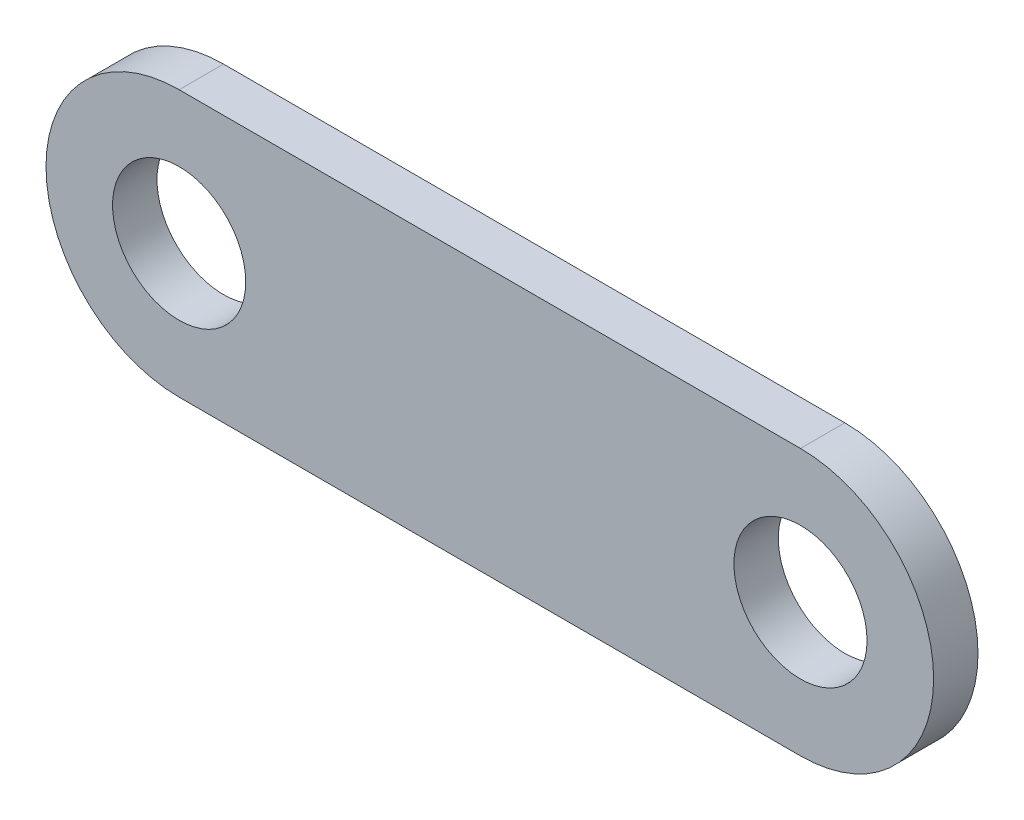
ISO-10303-21;
HEADER;
FILE_DESCRIPTION(('STEP AP214'),'2;1');
FILE_NAME('part.step','',(''),(''),'','','');
FILE_SCHEMA(('AUTOMOTIVE_DESIGN { 1 0 10303 214 1 1 1 1 }'));
ENDSEC;
DATA;
#1=APPLICATION_CONTEXT('core data for automotive mechanical design processes');
#2=APPLICATION_PROTOCOL_DEFINITION('international standard','automotive_design',2000,#1);
#3=PRODUCT_CONTEXT('',#1,'mechanical');
#4=PRODUCT('Part','Part','',(#3));
#5=PRODUCT_RELATED_PRODUCT_CATEGORY('part','',(#4));
#6=PRODUCT_DEFINITION_FORMATION('','',#4);
#7=PRODUCT_DEFINITION_CONTEXT('part definition',#1,'design');
#8=PRODUCT_DEFINITION('design','',#6,#7);
#9=PRODUCT_DEFINITION_SHAPE('','',#8);
#10=(LENGTH_UNIT() NAMED_UNIT(*) SI_UNIT(.MILLI.,.METRE.));
#11=(NAMED_UNIT(*) PLANE_ANGLE_UNIT() SI_UNIT($,.RADIAN.));
#12=(NAMED_UNIT(*) SI_UNIT($,.STERADIAN.) SOLID_ANGLE_UNIT());
#13=UNCERTAINTY_MEASURE_WITH_UNIT(LENGTH_MEASURE(1.E-05),#10,'distance_accuracy_value','');
#14=(GEOMETRIC_REPRESENTATION_CONTEXT(3) GLOBAL_UNCERTAINTY_ASSIGNED_CONTEXT((#13)) GLOBAL_UNIT_ASSIGNED_CONTEXT((#10,
#11,#12)) REPRESENTATION_CONTEXT('',''));
#15=CARTESIAN_POINT('',(0.,0.,0.));
#16=DIRECTION('',(0.,0.,1.));
#17=DIRECTION('',(1.,0.,0.));
#18=AXIS2_PLACEMENT_3D('',#15,#16,#17);
#19=CARTESIAN_POINT('',(0.,0.,-3.175));
#20=DIRECTION('',(0.,0.,1.));
#21=DIRECTION('',(1.,0.,0.));
#22=AXIS2_PLACEMENT_3D('',#19,#20,#21);
#23=CYLINDRICAL_SURFACE('',#22,9.525);
#24=CARTESIAN_POINT('',(0.,0.,0.));
#25=DIRECTION('',(0.,0.,1.));
#26=DIRECTION('',(1.,0.,0.));
#27=AXIS2_PLACEMENT_3D('',#24,#25,#26);
#28=CIRCLE('',#27,9.525);
#29=CARTESIAN_POINT('',(0.,-9.525,0.));
#30=VERTEX_POINT('',#29);
#31=CARTESIAN_POINT('',(0.,9.525,0.));
#32=VERTEX_POINT('',#31);
#33=EDGE_CURVE('E116',#30,#32,#28,.T.);
#34=ORIENTED_EDGE('',*,*,#33,.F.);
#35=DIRECTION('',(0.,0.,1.));
#36=VECTOR('',#35,1.);
#37=CARTESIAN_POINT('',(0.,-9.525,-3.175));
#38=LINE('',#37,#36);
#39=CARTESIAN_POINT('',(0.,-9.525,-3.175));
#40=VERTEX_POINT('',#39);
#41=EDGE_CURVE('E13',#40,#30,#38,.T.);
#42=ORIENTED_EDGE('',*,*,#41,.F.);
#43=CARTESIAN_POINT('',(0.,0.,-3.175));
#44=DIRECTION('',(0.,0.,1.));
#45=DIRECTION('',(1.,0.,0.));
#46=AXIS2_PLACEMENT_3D('',#43,#44,#45);
#47=CIRCLE('',#46,9.525);
#48=CARTESIAN_POINT('',(0.,9.525,-3.175));
#49=VERTEX_POINT('',#48);
#50=EDGE_CURVE('E109',#40,#49,#47,.T.);
#51=ORIENTED_EDGE('',*,*,#50,.T.);
#52=DIRECTION('',(0.,0.,1.));
#53=VECTOR('',#52,1.);
#54=CARTESIAN_POINT('',(0.,9.525,-3.175));
#55=LINE('',#54,#53);
#56=EDGE_CURVE('E54',#49,#32,#55,.T.);
#57=ORIENTED_EDGE('',*,*,#56,.T.);
#58=EDGE_LOOP('',(#34,#42,#51,#57));
#59=FACE_BOUND('',#58,.T.);
#60=ADVANCED_FACE('F51',(#59),#23,.T.);
#61=CARTESIAN_POINT('',(0.,-9.525,-3.175));
#62=DIRECTION('',(0.,-1.,0.));
#63=DIRECTION('',(1.,0.,0.));
#64=AXIS2_PLACEMENT_3D('',#61,#62,#63);
#65=PLANE('',#64);
#66=DIRECTION('',(1.,0.,0.));
#67=VECTOR('',#66,1.);
#68=CARTESIAN_POINT('',(0.,-9.525,0.));
#69=LINE('',#68,#67);
#70=CARTESIAN_POINT('',(-44.45,-9.525,0.));
#71=VERTEX_POINT('',#70);
#72=EDGE_CURVE('E111',#71,#30,#69,.T.);
#73=ORIENTED_EDGE('',*,*,#72,.F.);
#74=DIRECTION('',(0.,0.,1.));
#75=VECTOR('',#74,1.);
#76=CARTESIAN_POINT('',(-44.45,-9.525,-3.175));
#77=LINE('',#76,#75);
#78=CARTESIAN_POINT('',(-44.45,-9.525,-3.175));
#79=VERTEX_POINT('',#78);
#80=EDGE_CURVE('E60',#79,#71,#77,.T.);
#81=ORIENTED_EDGE('',*,*,#80,.F.);
#82=DIRECTION('',(1.,0.,0.));
#83=VECTOR('',#82,1.);
#84=CARTESIAN_POINT('',(0.,-9.525,-3.175));
#85=LINE('',#84,#83);
#86=EDGE_CURVE('E106',#79,#40,#85,.T.);
#87=ORIENTED_EDGE('',*,*,#86,.T.);
#88=ORIENTED_EDGE('',*,*,#41,.T.);
#89=EDGE_LOOP('',(#73,#81,#87,#88));
#90=FACE_BOUND('',#89,.T.);
#91=ADVANCED_FACE('F127',(#90),#65,.T.);
#92=CARTESIAN_POINT('',(-44.45,0.,-3.175));
#93=DIRECTION('',(0.,0.,1.));
#94=DIRECTION('',(1.,0.,0.));
#95=AXIS2_PLACEMENT_3D('',#92,#93,#94);
#96=CYLINDRICAL_SURFACE('',#95,9.525);
#97=CARTESIAN_POINT('',(-44.45,0.,0.));
#98=DIRECTION('',(0.,0.,1.));
#99=DIRECTION('',(1.,0.,0.));
#100=AXIS2_PLACEMENT_3D('',#97,#98,#99);
#101=CIRCLE('',#100,9.525);
#102=CARTESIAN_POINT('',(-44.45,9.52499999999999,0.));
#103=VERTEX_POINT('',#102);
#104=EDGE_CURVE('E101',#103,#71,#101,.T.);
#105=ORIENTED_EDGE('',*,*,#104,.F.);
#106=DIRECTION('',(0.,0.,1.));
#107=VECTOR('',#106,1.);
#108=CARTESIAN_POINT('',(-44.45,9.52499999999999,-3.175));
#109=LINE('',#108,#107);
#110=CARTESIAN_POINT('',(-44.45,9.52499999999999,-3.175));
#111=VERTEX_POINT('',#110);
#112=EDGE_CURVE('E96',#111,#103,#109,.T.);
#113=ORIENTED_EDGE('',*,*,#112,.F.);
#114=CARTESIAN_POINT('',(-44.45,0.,-3.175));
#115=DIRECTION('',(0.,0.,1.));
#116=DIRECTION('',(1.,0.,0.));
#117=AXIS2_PLACEMENT_3D('',#114,#115,#116);
#118=CIRCLE('',#117,9.525);
#119=EDGE_CURVE('E99',#111,#79,#118,.T.);
#120=ORIENTED_EDGE('',*,*,#119,.T.);
#121=ORIENTED_EDGE('',*,*,#80,.T.);
#122=EDGE_LOOP('',(#105,#113,#120,#121));
#123=FACE_BOUND('',#122,.T.);
#124=ADVANCED_FACE('F98',(#123),#96,.T.);
#125=CARTESIAN_POINT('',(0.,9.525,-3.175));
#126=DIRECTION('',(0.,1.,0.));
#127=DIRECTION('',(-1.,0.,0.));
#128=AXIS2_PLACEMENT_3D('',#125,#126,#127);
#129=PLANE('',#128);
#130=DIRECTION('',(-1.,0.,0.));
#131=VECTOR('',#130,1.);
#132=CARTESIAN_POINT('',(0.,9.525,0.));
#133=LINE('',#132,#131);
#134=EDGE_CURVE('E119',#32,#103,#133,.T.);
#135=ORIENTED_EDGE('',*,*,#134,.F.);
#136=ORIENTED_EDGE('',*,*,#56,.F.);
#137=DIRECTION('',(-1.,0.,0.));
#138=VECTOR('',#137,1.);
#139=CARTESIAN_POINT('',(0.,9.525,-3.175));
#140=LINE('',#139,#138);
#141=EDGE_CURVE('E105',#49,#111,#140,.T.);
#142=ORIENTED_EDGE('',*,*,#141,.T.);
#143=ORIENTED_EDGE('',*,*,#112,.T.);
#144=EDGE_LOOP('',(#135,#136,#142,#143));
#145=FACE_BOUND('',#144,.T.);
#146=ADVANCED_FACE('F108',(#145),#129,.T.);
#147=CARTESIAN_POINT('',(0.,0.,-3.175));
#148=DIRECTION('',(0.,0.,1.));
#149=DIRECTION('',(1.,0.,0.));
#150=AXIS2_PLACEMENT_3D('',#147,#148,#149);
#151=PLANE('',#150);
#152=CARTESIAN_POINT('',(0.,0.,-3.175));
#153=DIRECTION('',(0.,0.,1.));
#154=DIRECTION('',(1.,0.,0.));
#155=AXIS2_PLACEMENT_3D('',#152,#153,#154);
#156=CIRCLE('',#155,4.7625);
#157=CARTESIAN_POINT('',(4.7625,0.,-3.175));
#158=VERTEX_POINT('',#157);
#159=EDGE_CURVE('E160',#158,#158,#156,.T.);
#160=ORIENTED_EDGE('',*,*,#159,.T.);
#161=EDGE_LOOP('',(#160));
#162=FACE_BOUND('',#161,.T.);
#163=CARTESIAN_POINT('',(-44.45,0.,-3.175));
#164=DIRECTION('',(0.,0.,1.));
#165=DIRECTION('',(1.,0.,0.));
#166=AXIS2_PLACEMENT_3D('',#163,#164,#165);
#167=CIRCLE('',#166,4.7625);
#168=CARTESIAN_POINT('',(-39.6875,0.,-3.175));
#169=VERTEX_POINT('',#168);
#170=EDGE_CURVE('E120',#169,#169,#167,.T.);
#171=ORIENTED_EDGE('',*,*,#170,.T.);
#172=EDGE_LOOP('',(#171));
#173=FACE_BOUND('',#172,.T.);
#174=ORIENTED_EDGE('',*,*,#50,.F.);
#175=ORIENTED_EDGE('',*,*,#86,.F.);
#176=ORIENTED_EDGE('',*,*,#119,.F.);
#177=ORIENTED_EDGE('',*,*,#141,.F.);
#178=EDGE_LOOP('',(#174,#175,#176,#177));
#179=FACE_BOUND('',#178,.T.);
#180=ADVANCED_FACE('F104',(#162,#173,#179),#151,.F.);
#181=CARTESIAN_POINT('',(0.,0.,0.));
#182=DIRECTION('',(0.,0.,1.));
#183=DIRECTION('',(1.,0.,0.));
#184=AXIS2_PLACEMENT_3D('',#181,#182,#183);
#185=PLANE('',#184);
#186=CARTESIAN_POINT('',(0.,0.,0.));
#187=DIRECTION('',(0.,0.,1.));
#188=DIRECTION('',(1.,0.,0.));
#189=AXIS2_PLACEMENT_3D('',#186,#187,#188);
#190=CIRCLE('',#189,4.7625);
#191=CARTESIAN_POINT('',(4.7625,0.,0.));
#192=VERTEX_POINT('',#191);
#193=EDGE_CURVE('E163',#192,#192,#190,.T.);
#194=ORIENTED_EDGE('',*,*,#193,.F.);
#195=EDGE_LOOP('',(#194));
#196=FACE_BOUND('',#195,.T.);
#197=CARTESIAN_POINT('',(-44.45,0.,0.));
#198=DIRECTION('',(0.,0.,1.));
#199=DIRECTION('',(1.,0.,0.));
#200=AXIS2_PLACEMENT_3D('',#197,#198,#199);
#201=CIRCLE('',#200,4.7625);
#202=CARTESIAN_POINT('',(-39.6875,0.,0.));
#203=VERTEX_POINT('',#202);
#204=EDGE_CURVE('E165',#203,#203,#201,.T.);
#205=ORIENTED_EDGE('',*,*,#204,.F.);
#206=EDGE_LOOP('',(#205));
#207=FACE_BOUND('',#206,.T.);
#208=ORIENTED_EDGE('',*,*,#33,.T.);
#209=ORIENTED_EDGE('',*,*,#134,.T.);
#210=ORIENTED_EDGE('',*,*,#104,.T.);
#211=ORIENTED_EDGE('',*,*,#72,.T.);
#212=EDGE_LOOP('',(#208,#209,#210,#211));
#213=FACE_BOUND('',#212,.T.);
#214=ADVANCED_FACE('F126',(#196,#207,#213),#185,.T.);
#215=CARTESIAN_POINT('',(-44.45,0.,-3.175));
#216=DIRECTION('',(0.,0.,1.));
#217=DIRECTION('',(1.,0.,0.));
#218=AXIS2_PLACEMENT_3D('',#215,#216,#217);
#219=CYLINDRICAL_SURFACE('',#218,4.7625);
#220=ORIENTED_EDGE('',*,*,#170,.F.);
#221=EDGE_LOOP('',(#220));
#222=FACE_BOUND('',#221,.T.);
#223=ORIENTED_EDGE('',*,*,#204,.T.);
#224=EDGE_LOOP('',(#223));
#225=FACE_BOUND('',#224,.T.);
#226=ADVANCED_FACE('F145',(#222,#225),#219,.F.);
#227=CARTESIAN_POINT('',(0.,0.,-3.175));
#228=DIRECTION('',(0.,0.,1.));
#229=DIRECTION('',(1.,0.,0.));
#230=AXIS2_PLACEMENT_3D('',#227,#228,#229);
#231=CYLINDRICAL_SURFACE('',#230,4.7625);
#232=ORIENTED_EDGE('',*,*,#159,.F.);
#233=EDGE_LOOP('',(#232));
#234=FACE_BOUND('',#233,.T.);
#235=ORIENTED_EDGE('',*,*,#193,.T.);
#236=EDGE_LOOP('',(#235));
#237=FACE_BOUND('',#236,.T.);
#238=ADVANCED_FACE('F152',(#234,#237),#231,.F.);
#239=CLOSED_SHELL('',(#60,#91,#124,#146,#180,#214,#226,#238));
#240=MANIFOLD_SOLID_BREP('B2',#239);
#241=ADVANCED_BREP_SHAPE_REPRESENTATION('',(#18,#240),#14);
#242=SHAPE_DEFINITION_REPRESENTATION(#9,#241);
ENDSEC;
END-ISO-10303-21;
